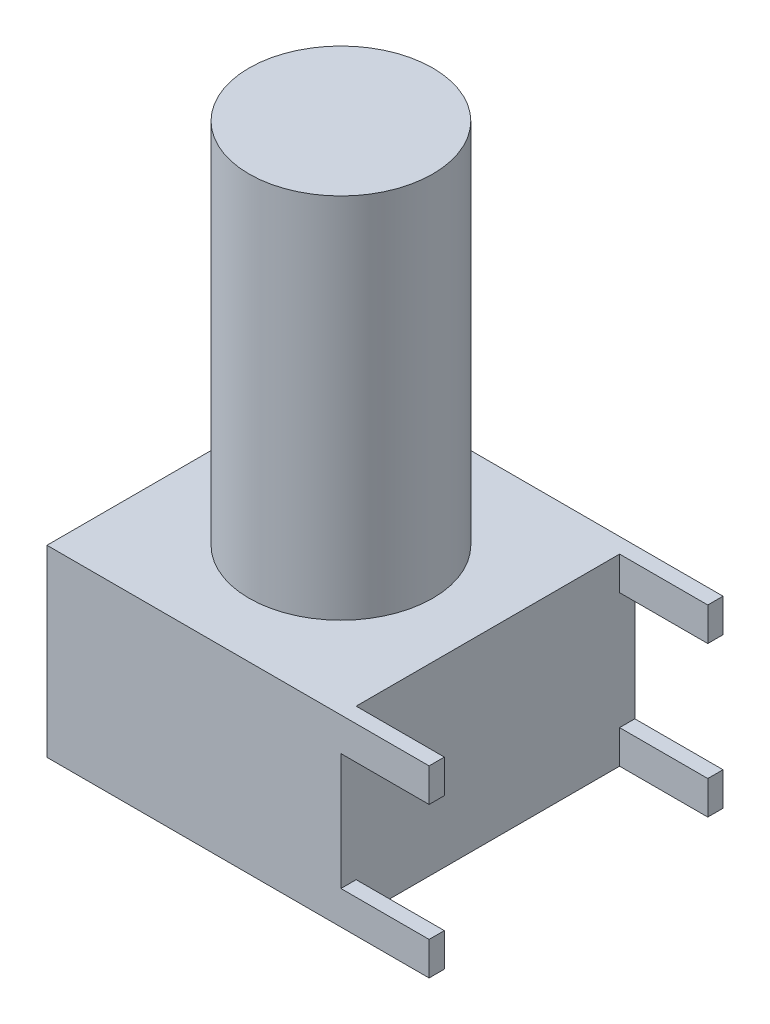
ISO-10303-21;
HEADER;
FILE_DESCRIPTION(('STEP AP214'),'2;1');
FILE_NAME('part.step','',(''),(''),'','','');
FILE_SCHEMA(('AUTOMOTIVE_DESIGN { 1 0 10303 214 1 1 1 1 }'));
ENDSEC;
DATA;
#1=APPLICATION_CONTEXT('core data for automotive mechanical design processes');
#2=APPLICATION_PROTOCOL_DEFINITION('international standard','automotive_design',2000,#1);
#3=PRODUCT_CONTEXT('',#1,'mechanical');
#4=PRODUCT('Part','Part','',(#3));
#5=PRODUCT_RELATED_PRODUCT_CATEGORY('part','',(#4));
#6=PRODUCT_DEFINITION_FORMATION('','',#4);
#7=PRODUCT_DEFINITION_CONTEXT('part definition',#1,'design');
#8=PRODUCT_DEFINITION('design','',#6,#7);
#9=PRODUCT_DEFINITION_SHAPE('','',#8);
#10=(LENGTH_UNIT() NAMED_UNIT(*) SI_UNIT(.MILLI.,.METRE.));
#11=(NAMED_UNIT(*) PLANE_ANGLE_UNIT() SI_UNIT($,.RADIAN.));
#12=(NAMED_UNIT(*) SI_UNIT($,.STERADIAN.) SOLID_ANGLE_UNIT());
#13=UNCERTAINTY_MEASURE_WITH_UNIT(LENGTH_MEASURE(1.E-05),#10,'distance_accuracy_value','');
#14=(GEOMETRIC_REPRESENTATION_CONTEXT(3) GLOBAL_UNCERTAINTY_ASSIGNED_CONTEXT((#13)) GLOBAL_UNIT_ASSIGNED_CONTEXT((#10,
#11,#12)) REPRESENTATION_CONTEXT('',''));
#15=CARTESIAN_POINT('',(0.,0.,0.));
#16=DIRECTION('',(0.,0.,1.));
#17=DIRECTION('',(1.,0.,0.));
#18=AXIS2_PLACEMENT_3D('',#15,#16,#17);
#19=CARTESIAN_POINT('',(5.08,-6.35,5.08));
#20=DIRECTION('',(1.,0.,0.));
#21=DIRECTION('',(0.,0.,-1.));
#22=AXIS2_PLACEMENT_3D('',#19,#20,#21);
#23=PLANE('',#22);
#24=DIRECTION('',(0.,0.,-1.));
#25=VECTOR('',#24,1.);
#26=CARTESIAN_POINT('',(5.08,-5.19481780329537,0.));
#27=LINE('',#26,#25);
#28=CARTESIAN_POINT('',(5.08,-5.19481780329537,5.08));
#29=VERTEX_POINT('',#28);
#30=CARTESIAN_POINT('',(5.08,-5.19481780329537,4.5525943618685));
#31=VERTEX_POINT('',#30);
#32=EDGE_CURVE('E51',#29,#31,#27,.T.);
#33=ORIENTED_EDGE('',*,*,#32,.T.);
#34=DIRECTION('',(0.,1.,0.));
#35=VECTOR('',#34,1.);
#36=CARTESIAN_POINT('',(5.08,0.,4.5525943618685));
#37=LINE('',#36,#35);
#38=CARTESIAN_POINT('',(5.08,-6.35,4.5525943618685));
#39=VERTEX_POINT('',#38);
#40=EDGE_CURVE('E462',#39,#31,#37,.T.);
#41=ORIENTED_EDGE('',*,*,#40,.F.);
#42=DIRECTION('',(0.,0.,-1.));
#43=VECTOR('',#42,1.);
#44=CARTESIAN_POINT('',(5.08,-6.35,5.08));
#45=LINE('',#44,#43);
#46=CARTESIAN_POINT('',(5.08,-6.35,-4.5525943618685));
#47=VERTEX_POINT('',#46);
#48=EDGE_CURVE('E171',#39,#47,#45,.T.);
#49=ORIENTED_EDGE('',*,*,#48,.T.);
#50=DIRECTION('',(0.,1.,0.));
#51=VECTOR('',#50,1.);
#52=CARTESIAN_POINT('',(5.08,0.,-4.5525943618685));
#53=LINE('',#52,#51);
#54=CARTESIAN_POINT('',(5.08,-5.19481780329537,-4.5525943618685));
#55=VERTEX_POINT('',#54);
#56=EDGE_CURVE('E172',#47,#55,#53,.T.);
#57=ORIENTED_EDGE('',*,*,#56,.T.);
#58=DIRECTION('',(0.,0.,1.));
#59=VECTOR('',#58,1.);
#60=CARTESIAN_POINT('',(5.08,-5.19481780329537,0.));
#61=LINE('',#60,#59);
#62=CARTESIAN_POINT('',(5.08,-5.19481780329537,-5.08));
#63=VERTEX_POINT('',#62);
#64=EDGE_CURVE('E174',#63,#55,#61,.T.);
#65=ORIENTED_EDGE('',*,*,#64,.F.);
#66=DIRECTION('',(0.,1.,0.));
#67=VECTOR('',#66,1.);
#68=CARTESIAN_POINT('',(5.08,-6.35,-5.08));
#69=LINE('',#68,#67);
#70=CARTESIAN_POINT('',(5.08,-1.15518219670463,-5.08));
#71=VERTEX_POINT('',#70);
#72=EDGE_CURVE('E274',#63,#71,#69,.T.);
#73=ORIENTED_EDGE('',*,*,#72,.T.);
#74=DIRECTION('',(0.,0.,-1.));
#75=VECTOR('',#74,1.);
#76=CARTESIAN_POINT('',(5.08,-1.15518219670463,0.));
#77=LINE('',#76,#75);
#78=CARTESIAN_POINT('',(5.08,-1.15518219670463,-4.5525943618685));
#79=VERTEX_POINT('',#78);
#80=EDGE_CURVE('E205',#79,#71,#77,.T.);
#81=ORIENTED_EDGE('',*,*,#80,.F.);
#82=DIRECTION('',(0.,1.,0.));
#83=VECTOR('',#82,1.);
#84=CARTESIAN_POINT('',(5.08,0.,-4.5525943618685));
#85=LINE('',#84,#83);
#86=CARTESIAN_POINT('',(5.08,0.,-4.5525943618685));
#87=VERTEX_POINT('',#86);
#88=EDGE_CURVE('E200',#79,#87,#85,.T.);
#89=ORIENTED_EDGE('',*,*,#88,.T.);
#90=DIRECTION('',(0.,0.,-1.));
#91=VECTOR('',#90,1.);
#92=CARTESIAN_POINT('',(5.08,0.,5.08));
#93=LINE('',#92,#91);
#94=CARTESIAN_POINT('',(5.08,0.,4.5525943618685));
#95=VERTEX_POINT('',#94);
#96=EDGE_CURVE('E256',#95,#87,#93,.T.);
#97=ORIENTED_EDGE('',*,*,#96,.F.);
#98=DIRECTION('',(0.,-1.,0.));
#99=VECTOR('',#98,1.);
#100=CARTESIAN_POINT('',(5.08,0.,4.5525943618685));
#101=LINE('',#100,#99);
#102=CARTESIAN_POINT('',(5.08,-1.15518219670463,4.5525943618685));
#103=VERTEX_POINT('',#102);
#104=EDGE_CURVE('E224',#95,#103,#101,.T.);
#105=ORIENTED_EDGE('',*,*,#104,.T.);
#106=DIRECTION('',(0.,0.,-1.));
#107=VECTOR('',#106,1.);
#108=CARTESIAN_POINT('',(5.08,-1.15518219670463,0.));
#109=LINE('',#108,#107);
#110=CARTESIAN_POINT('',(5.08,-1.15518219670463,5.08));
#111=VERTEX_POINT('',#110);
#112=EDGE_CURVE('E229',#111,#103,#109,.T.);
#113=ORIENTED_EDGE('',*,*,#112,.F.);
#114=DIRECTION('',(0.,1.,0.));
#115=VECTOR('',#114,1.);
#116=CARTESIAN_POINT('',(5.08,-6.35,5.08));
#117=LINE('',#116,#115);
#118=EDGE_CURVE('E37',#29,#111,#117,.T.);
#119=ORIENTED_EDGE('',*,*,#118,.F.);
#120=EDGE_LOOP('',(#33,#41,#49,#57,#65,#73,#81,#89,#97,#105,#113,#119));
#121=FACE_BOUND('',#120,.T.);
#122=ADVANCED_FACE('F33',(#121),#23,.T.);
#123=CARTESIAN_POINT('',(0.,12.7,0.));
#124=DIRECTION('',(0.,-1.,0.));
#125=DIRECTION('',(0.,0.,-1.));
#126=AXIS2_PLACEMENT_3D('',#123,#124,#125);
#127=CYLINDRICAL_SURFACE('',#126,3.175);
#128=CARTESIAN_POINT('',(0.,12.7,0.));
#129=DIRECTION('',(0.,1.,0.));
#130=DIRECTION('',(0.,0.,1.));
#131=AXIS2_PLACEMENT_3D('',#128,#129,#130);
#132=CIRCLE('',#131,3.175);
#133=CARTESIAN_POINT('',(0.,12.7,3.175));
#134=VERTEX_POINT('',#133);
#135=EDGE_CURVE('E11',#134,#134,#132,.T.);
#136=ORIENTED_EDGE('',*,*,#135,.F.);
#137=EDGE_LOOP('',(#136));
#138=FACE_BOUND('',#137,.T.);
#139=CARTESIAN_POINT('',(0.,0.,0.));
#140=DIRECTION('',(0.,1.,0.));
#141=DIRECTION('',(0.,0.,1.));
#142=AXIS2_PLACEMENT_3D('',#139,#140,#141);
#143=CIRCLE('',#142,3.175);
#144=CARTESIAN_POINT('',(0.,0.,3.175));
#145=VERTEX_POINT('',#144);
#146=EDGE_CURVE('E43',#145,#145,#143,.T.);
#147=ORIENTED_EDGE('',*,*,#146,.T.);
#148=EDGE_LOOP('',(#147));
#149=FACE_BOUND('',#148,.T.);
#150=ADVANCED_FACE('F35',(#138,#149),#127,.T.);
#151=CARTESIAN_POINT('',(0.,12.7,0.));
#152=DIRECTION('',(0.,1.,0.));
#153=DIRECTION('',(0.,0.,1.));
#154=AXIS2_PLACEMENT_3D('',#151,#152,#153);
#155=PLANE('',#154);
#156=ORIENTED_EDGE('',*,*,#135,.T.);
#157=EDGE_LOOP('',(#156));
#158=FACE_BOUND('',#157,.T.);
#159=ADVANCED_FACE('F283',(#158),#155,.T.);
#160=CARTESIAN_POINT('',(0.,0.,0.));
#161=DIRECTION('',(0.,1.,0.));
#162=DIRECTION('',(0.,0.,1.));
#163=AXIS2_PLACEMENT_3D('',#160,#161,#162);
#164=PLANE('',#163);
#165=DIRECTION('',(1.,0.,0.));
#166=VECTOR('',#165,1.);
#167=CARTESIAN_POINT('',(-5.08,0.,5.08));
#168=LINE('',#167,#166);
#169=CARTESIAN_POINT('',(-5.08,0.,5.08));
#170=VERTEX_POINT('',#169);
#171=CARTESIAN_POINT('',(8.128,0.,5.08));
#172=VERTEX_POINT('',#171);
#173=EDGE_CURVE('E246',#170,#172,#168,.T.);
#174=ORIENTED_EDGE('',*,*,#173,.T.);
#175=DIRECTION('',(0.,0.,1.));
#176=VECTOR('',#175,1.);
#177=CARTESIAN_POINT('',(8.128,0.,0.));
#178=LINE('',#177,#176);
#179=CARTESIAN_POINT('',(8.128,0.,4.5525943618685));
#180=VERTEX_POINT('',#179);
#181=EDGE_CURVE('E228',#180,#172,#178,.T.);
#182=ORIENTED_EDGE('',*,*,#181,.F.);
#183=DIRECTION('',(-1.,0.,0.));
#184=VECTOR('',#183,1.);
#185=CARTESIAN_POINT('',(8.128,0.,4.5525943618685));
#186=LINE('',#185,#184);
#187=EDGE_CURVE('E243',#180,#95,#186,.T.);
#188=ORIENTED_EDGE('',*,*,#187,.T.);
#189=ORIENTED_EDGE('',*,*,#96,.T.);
#190=DIRECTION('',(-1.,0.,0.));
#191=VECTOR('',#190,1.);
#192=CARTESIAN_POINT('',(8.128,0.,-4.5525943618685));
#193=LINE('',#192,#191);
#194=CARTESIAN_POINT('',(8.128,0.,-4.5525943618685));
#195=VERTEX_POINT('',#194);
#196=EDGE_CURVE('E212',#195,#87,#193,.T.);
#197=ORIENTED_EDGE('',*,*,#196,.F.);
#198=DIRECTION('',(0.,0.,1.));
#199=VECTOR('',#198,1.);
#200=CARTESIAN_POINT('',(8.128,0.,0.));
#201=LINE('',#200,#199);
#202=CARTESIAN_POINT('',(8.128,0.,-5.08));
#203=VERTEX_POINT('',#202);
#204=EDGE_CURVE('E210',#203,#195,#201,.T.);
#205=ORIENTED_EDGE('',*,*,#204,.F.);
#206=DIRECTION('',(1.,0.,0.));
#207=VECTOR('',#206,1.);
#208=CARTESIAN_POINT('',(-5.08,0.,-5.08));
#209=LINE('',#208,#207);
#210=CARTESIAN_POINT('',(-5.08,0.,-5.08));
#211=VERTEX_POINT('',#210);
#212=EDGE_CURVE('E259',#211,#203,#209,.T.);
#213=ORIENTED_EDGE('',*,*,#212,.F.);
#214=DIRECTION('',(0.,0.,-1.));
#215=VECTOR('',#214,1.);
#216=CARTESIAN_POINT('',(-5.08,0.,5.08));
#217=LINE('',#216,#215);
#218=EDGE_CURVE('E266',#170,#211,#217,.T.);
#219=ORIENTED_EDGE('',*,*,#218,.F.);
#220=EDGE_LOOP('',(#174,#182,#188,#189,#197,#205,#213,#219));
#221=FACE_BOUND('',#220,.T.);
#222=ORIENTED_EDGE('',*,*,#146,.F.);
#223=EDGE_LOOP('',(#222));
#224=FACE_BOUND('',#223,.T.);
#225=ADVANCED_FACE('F280',(#221,#224),#164,.T.);
#226=CARTESIAN_POINT('',(-5.08,-6.35,5.08));
#227=DIRECTION('',(0.,0.,1.));
#228=DIRECTION('',(1.,0.,0.));
#229=AXIS2_PLACEMENT_3D('',#226,#227,#228);
#230=PLANE('',#229);
#231=ORIENTED_EDGE('',*,*,#173,.F.);
#232=DIRECTION('',(0.,1.,0.));
#233=VECTOR('',#232,1.);
#234=CARTESIAN_POINT('',(-5.08,-6.35,5.08));
#235=LINE('',#234,#233);
#236=CARTESIAN_POINT('',(-5.08,-6.35,5.08));
#237=VERTEX_POINT('',#236);
#238=EDGE_CURVE('E269',#237,#170,#235,.T.);
#239=ORIENTED_EDGE('',*,*,#238,.F.);
#240=DIRECTION('',(1.,0.,0.));
#241=VECTOR('',#240,1.);
#242=CARTESIAN_POINT('',(-5.08,-6.35,5.08));
#243=LINE('',#242,#241);
#244=CARTESIAN_POINT('',(8.128,-6.35,5.08));
#245=VERTEX_POINT('',#244);
#246=EDGE_CURVE('E268',#237,#245,#243,.T.);
#247=ORIENTED_EDGE('',*,*,#246,.T.);
#248=DIRECTION('',(0.,-1.,0.));
#249=VECTOR('',#248,1.);
#250=CARTESIAN_POINT('',(8.128,0.,5.08));
#251=LINE('',#250,#249);
#252=CARTESIAN_POINT('',(8.128,-5.19481780329537,5.08));
#253=VERTEX_POINT('',#252);
#254=EDGE_CURVE('E165',#253,#245,#251,.T.);
#255=ORIENTED_EDGE('',*,*,#254,.F.);
#256=DIRECTION('',(-1.,0.,0.));
#257=VECTOR('',#256,1.);
#258=CARTESIAN_POINT('',(8.128,-5.19481780329537,5.08));
#259=LINE('',#258,#257);
#260=EDGE_CURVE('E176',#253,#29,#259,.T.);
#261=ORIENTED_EDGE('',*,*,#260,.T.);
#262=ORIENTED_EDGE('',*,*,#118,.T.);
#263=DIRECTION('',(-1.,0.,0.));
#264=VECTOR('',#263,1.);
#265=CARTESIAN_POINT('',(8.128,-1.15518219670463,5.08));
#266=LINE('',#265,#264);
#267=CARTESIAN_POINT('',(8.128,-1.15518219670463,5.08));
#268=VERTEX_POINT('',#267);
#269=EDGE_CURVE('E247',#268,#111,#266,.T.);
#270=ORIENTED_EDGE('',*,*,#269,.F.);
#271=DIRECTION('',(0.,-1.,0.));
#272=VECTOR('',#271,1.);
#273=CARTESIAN_POINT('',(8.128,0.,5.08));
#274=LINE('',#273,#272);
#275=EDGE_CURVE('E232',#172,#268,#274,.T.);
#276=ORIENTED_EDGE('',*,*,#275,.F.);
#277=EDGE_LOOP('',(#231,#239,#247,#255,#261,#262,#270,#276));
#278=FACE_BOUND('',#277,.T.);
#279=ADVANCED_FACE('F282',(#278),#230,.T.);
#280=CARTESIAN_POINT('',(-5.08,-6.35,5.08));
#281=DIRECTION('',(1.,0.,0.));
#282=DIRECTION('',(0.,0.,-1.));
#283=AXIS2_PLACEMENT_3D('',#280,#281,#282);
#284=PLANE('',#283);
#285=ORIENTED_EDGE('',*,*,#218,.T.);
#286=DIRECTION('',(0.,1.,0.));
#287=VECTOR('',#286,1.);
#288=CARTESIAN_POINT('',(-5.08,-6.35,-5.08));
#289=LINE('',#288,#287);
#290=CARTESIAN_POINT('',(-5.08,-6.35,-5.08));
#291=VERTEX_POINT('',#290);
#292=EDGE_CURVE('E271',#291,#211,#289,.T.);
#293=ORIENTED_EDGE('',*,*,#292,.F.);
#294=DIRECTION('',(0.,0.,-1.));
#295=VECTOR('',#294,1.);
#296=CARTESIAN_POINT('',(-5.08,-6.35,5.08));
#297=LINE('',#296,#295);
#298=EDGE_CURVE('E340',#237,#291,#297,.T.);
#299=ORIENTED_EDGE('',*,*,#298,.F.);
#300=ORIENTED_EDGE('',*,*,#238,.T.);
#301=EDGE_LOOP('',(#285,#293,#299,#300));
#302=FACE_BOUND('',#301,.T.);
#303=ADVANCED_FACE('F290',(#302),#284,.F.);
#304=CARTESIAN_POINT('',(-5.08,-6.35,-5.08));
#305=DIRECTION('',(0.,0.,1.));
#306=DIRECTION('',(1.,0.,0.));
#307=AXIS2_PLACEMENT_3D('',#304,#305,#306);
#308=PLANE('',#307);
#309=ORIENTED_EDGE('',*,*,#212,.T.);
#310=DIRECTION('',(0.,1.,0.));
#311=VECTOR('',#310,1.);
#312=CARTESIAN_POINT('',(8.128,0.,-5.08));
#313=LINE('',#312,#311);
#314=CARTESIAN_POINT('',(8.128,-1.15518219670463,-5.08));
#315=VERTEX_POINT('',#314);
#316=EDGE_CURVE('E207',#315,#203,#313,.T.);
#317=ORIENTED_EDGE('',*,*,#316,.F.);
#318=DIRECTION('',(-1.,0.,0.));
#319=VECTOR('',#318,1.);
#320=CARTESIAN_POINT('',(8.128,-1.15518219670463,-5.08));
#321=LINE('',#320,#319);
#322=EDGE_CURVE('E218',#315,#71,#321,.T.);
#323=ORIENTED_EDGE('',*,*,#322,.T.);
#324=ORIENTED_EDGE('',*,*,#72,.F.);
#325=DIRECTION('',(-1.,0.,0.));
#326=VECTOR('',#325,1.);
#327=CARTESIAN_POINT('',(8.128,-5.19481780329537,-5.08));
#328=LINE('',#327,#326);
#329=CARTESIAN_POINT('',(8.128,-5.19481780329537,-5.08));
#330=VERTEX_POINT('',#329);
#331=EDGE_CURVE('E195',#330,#63,#328,.T.);
#332=ORIENTED_EDGE('',*,*,#331,.F.);
#333=DIRECTION('',(0.,1.,0.));
#334=VECTOR('',#333,1.);
#335=CARTESIAN_POINT('',(8.128,0.,-5.08));
#336=LINE('',#335,#334);
#337=CARTESIAN_POINT('',(8.128,-6.35,-5.08));
#338=VERTEX_POINT('',#337);
#339=EDGE_CURVE('E186',#338,#330,#336,.T.);
#340=ORIENTED_EDGE('',*,*,#339,.F.);
#341=DIRECTION('',(1.,0.,0.));
#342=VECTOR('',#341,1.);
#343=CARTESIAN_POINT('',(-5.08,-6.35,-5.08));
#344=LINE('',#343,#342);
#345=EDGE_CURVE('E318',#291,#338,#344,.T.);
#346=ORIENTED_EDGE('',*,*,#345,.F.);
#347=ORIENTED_EDGE('',*,*,#292,.T.);
#348=EDGE_LOOP('',(#309,#317,#323,#324,#332,#340,#346,#347));
#349=FACE_BOUND('',#348,.T.);
#350=ADVANCED_FACE('F303',(#349),#308,.F.);
#351=CARTESIAN_POINT('',(0.,-6.35,0.));
#352=DIRECTION('',(0.,1.,0.));
#353=DIRECTION('',(0.,0.,1.));
#354=AXIS2_PLACEMENT_3D('',#351,#352,#353);
#355=PLANE('',#354);
#356=ORIENTED_EDGE('',*,*,#246,.F.);
#357=ORIENTED_EDGE('',*,*,#298,.T.);
#358=ORIENTED_EDGE('',*,*,#345,.T.);
#359=DIRECTION('',(0.,0.,-1.));
#360=VECTOR('',#359,1.);
#361=CARTESIAN_POINT('',(8.128,-6.35,0.));
#362=LINE('',#361,#360);
#363=CARTESIAN_POINT('',(8.128,-6.35,-4.5525943618685));
#364=VERTEX_POINT('',#363);
#365=EDGE_CURVE('E183',#364,#338,#362,.T.);
#366=ORIENTED_EDGE('',*,*,#365,.F.);
#367=DIRECTION('',(-1.,0.,0.));
#368=VECTOR('',#367,1.);
#369=CARTESIAN_POINT('',(8.128,-6.35,-4.5525943618685));
#370=LINE('',#369,#368);
#371=EDGE_CURVE('E198',#364,#47,#370,.T.);
#372=ORIENTED_EDGE('',*,*,#371,.T.);
#373=ORIENTED_EDGE('',*,*,#48,.F.);
#374=DIRECTION('',(-1.,0.,0.));
#375=VECTOR('',#374,1.);
#376=CARTESIAN_POINT('',(8.128,-6.35,4.5525943618685));
#377=LINE('',#376,#375);
#378=CARTESIAN_POINT('',(8.128,-6.35,4.5525943618685));
#379=VERTEX_POINT('',#378);
#380=EDGE_CURVE('E153',#379,#39,#377,.T.);
#381=ORIENTED_EDGE('',*,*,#380,.F.);
#382=DIRECTION('',(0.,0.,-1.));
#383=VECTOR('',#382,1.);
#384=CARTESIAN_POINT('',(8.128,-6.35,0.));
#385=LINE('',#384,#383);
#386=EDGE_CURVE('E159',#245,#379,#385,.T.);
#387=ORIENTED_EDGE('',*,*,#386,.F.);
#388=EDGE_LOOP('',(#356,#357,#358,#366,#372,#373,#381,#387));
#389=FACE_BOUND('',#388,.T.);
#390=ADVANCED_FACE('F169',(#389),#355,.F.);
#391=CARTESIAN_POINT('',(8.128,0.,4.5525943618685));
#392=DIRECTION('',(0.,0.,-1.));
#393=DIRECTION('',(-1.,0.,0.));
#394=AXIS2_PLACEMENT_3D('',#391,#392,#393);
#395=PLANE('',#394);
#396=ORIENTED_EDGE('',*,*,#104,.F.);
#397=ORIENTED_EDGE('',*,*,#187,.F.);
#398=DIRECTION('',(0.,-1.,0.));
#399=VECTOR('',#398,1.);
#400=CARTESIAN_POINT('',(8.128,0.,4.5525943618685));
#401=LINE('',#400,#399);
#402=CARTESIAN_POINT('',(8.128,-1.15518219670463,4.5525943618685));
#403=VERTEX_POINT('',#402);
#404=EDGE_CURVE('E225',#180,#403,#401,.T.);
#405=ORIENTED_EDGE('',*,*,#404,.T.);
#406=DIRECTION('',(-1.,0.,0.));
#407=VECTOR('',#406,1.);
#408=CARTESIAN_POINT('',(8.128,-1.15518219670463,4.5525943618685));
#409=LINE('',#408,#407);
#410=EDGE_CURVE('E236',#403,#103,#409,.T.);
#411=ORIENTED_EDGE('',*,*,#410,.T.);
#412=EDGE_LOOP('',(#396,#397,#405,#411));
#413=FACE_BOUND('',#412,.T.);
#414=ADVANCED_FACE('F354',(#413),#395,.T.);
#415=CARTESIAN_POINT('',(8.128,-1.15518219670463,0.));
#416=DIRECTION('',(0.,1.,0.));
#417=DIRECTION('',(0.,0.,1.));
#418=AXIS2_PLACEMENT_3D('',#415,#416,#417);
#419=PLANE('',#418);
#420=ORIENTED_EDGE('',*,*,#112,.T.);
#421=ORIENTED_EDGE('',*,*,#410,.F.);
#422=DIRECTION('',(0.,0.,-1.));
#423=VECTOR('',#422,1.);
#424=CARTESIAN_POINT('',(8.128,-1.15518219670463,0.));
#425=LINE('',#424,#423);
#426=EDGE_CURVE('E234',#268,#403,#425,.T.);
#427=ORIENTED_EDGE('',*,*,#426,.F.);
#428=ORIENTED_EDGE('',*,*,#269,.T.);
#429=EDGE_LOOP('',(#420,#421,#427,#428));
#430=FACE_BOUND('',#429,.T.);
#431=ADVANCED_FACE('F364',(#430),#419,.F.);
#432=CARTESIAN_POINT('',(8.128,0.,0.));
#433=DIRECTION('',(1.,0.,0.));
#434=DIRECTION('',(0.,0.,-1.));
#435=AXIS2_PLACEMENT_3D('',#432,#433,#434);
#436=PLANE('',#435);
#437=ORIENTED_EDGE('',*,*,#404,.F.);
#438=ORIENTED_EDGE('',*,*,#181,.T.);
#439=ORIENTED_EDGE('',*,*,#275,.T.);
#440=ORIENTED_EDGE('',*,*,#426,.T.);
#441=EDGE_LOOP('',(#437,#438,#439,#440));
#442=FACE_BOUND('',#441,.T.);
#443=ADVANCED_FACE('F348',(#442),#436,.T.);
#444=CARTESIAN_POINT('',(8.128,0.,-4.5525943618685));
#445=DIRECTION('',(0.,0.,1.));
#446=DIRECTION('',(1.,0.,0.));
#447=AXIS2_PLACEMENT_3D('',#444,#445,#446);
#448=PLANE('',#447);
#449=ORIENTED_EDGE('',*,*,#88,.F.);
#450=DIRECTION('',(-1.,0.,0.));
#451=VECTOR('',#450,1.);
#452=CARTESIAN_POINT('',(8.128,-1.15518219670463,-4.5525943618685));
#453=LINE('',#452,#451);
#454=CARTESIAN_POINT('',(8.128,-1.15518219670463,-4.5525943618685));
#455=VERTEX_POINT('',#454);
#456=EDGE_CURVE('E221',#455,#79,#453,.T.);
#457=ORIENTED_EDGE('',*,*,#456,.F.);
#458=DIRECTION('',(0.,1.,0.));
#459=VECTOR('',#458,1.);
#460=CARTESIAN_POINT('',(8.128,0.,-4.5525943618685));
#461=LINE('',#460,#459);
#462=EDGE_CURVE('E201',#455,#195,#461,.T.);
#463=ORIENTED_EDGE('',*,*,#462,.T.);
#464=ORIENTED_EDGE('',*,*,#196,.T.);
#465=EDGE_LOOP('',(#449,#457,#463,#464));
#466=FACE_BOUND('',#465,.T.);
#467=ADVANCED_FACE('F356',(#466),#448,.T.);
#468=CARTESIAN_POINT('',(8.128,-1.15518219670463,0.));
#469=DIRECTION('',(0.,1.,0.));
#470=DIRECTION('',(0.,0.,1.));
#471=AXIS2_PLACEMENT_3D('',#468,#469,#470);
#472=PLANE('',#471);
#473=ORIENTED_EDGE('',*,*,#80,.T.);
#474=ORIENTED_EDGE('',*,*,#322,.F.);
#475=DIRECTION('',(0.,0.,-1.));
#476=VECTOR('',#475,1.);
#477=CARTESIAN_POINT('',(8.128,-1.15518219670463,0.));
#478=LINE('',#477,#476);
#479=EDGE_CURVE('E204',#455,#315,#478,.T.);
#480=ORIENTED_EDGE('',*,*,#479,.F.);
#481=ORIENTED_EDGE('',*,*,#456,.T.);
#482=EDGE_LOOP('',(#473,#474,#480,#481));
#483=FACE_BOUND('',#482,.T.);
#484=ADVANCED_FACE('F329',(#483),#472,.F.);
#485=CARTESIAN_POINT('',(8.128,0.,0.));
#486=DIRECTION('',(1.,0.,0.));
#487=DIRECTION('',(0.,0.,-1.));
#488=AXIS2_PLACEMENT_3D('',#485,#486,#487);
#489=PLANE('',#488);
#490=ORIENTED_EDGE('',*,*,#462,.F.);
#491=ORIENTED_EDGE('',*,*,#479,.T.);
#492=ORIENTED_EDGE('',*,*,#316,.T.);
#493=ORIENTED_EDGE('',*,*,#204,.T.);
#494=EDGE_LOOP('',(#490,#491,#492,#493));
#495=FACE_BOUND('',#494,.T.);
#496=ADVANCED_FACE('F323',(#495),#489,.T.);
#497=CARTESIAN_POINT('',(8.128,0.,-4.5525943618685));
#498=DIRECTION('',(0.,0.,1.));
#499=DIRECTION('',(1.,0.,0.));
#500=AXIS2_PLACEMENT_3D('',#497,#498,#499);
#501=PLANE('',#500);
#502=ORIENTED_EDGE('',*,*,#56,.F.);
#503=ORIENTED_EDGE('',*,*,#371,.F.);
#504=DIRECTION('',(0.,1.,0.));
#505=VECTOR('',#504,1.);
#506=CARTESIAN_POINT('',(8.128,0.,-4.5525943618685));
#507=LINE('',#506,#505);
#508=CARTESIAN_POINT('',(8.128,-5.19481780329537,-4.5525943618685));
#509=VERTEX_POINT('',#508);
#510=EDGE_CURVE('E180',#364,#509,#507,.T.);
#511=ORIENTED_EDGE('',*,*,#510,.T.);
#512=DIRECTION('',(-1.,0.,0.));
#513=VECTOR('',#512,1.);
#514=CARTESIAN_POINT('',(8.128,-5.19481780329537,-4.5525943618685));
#515=LINE('',#514,#513);
#516=EDGE_CURVE('E189',#509,#55,#515,.T.);
#517=ORIENTED_EDGE('',*,*,#516,.T.);
#518=EDGE_LOOP('',(#502,#503,#511,#517));
#519=FACE_BOUND('',#518,.T.);
#520=ADVANCED_FACE('F408',(#519),#501,.T.);
#521=CARTESIAN_POINT('',(8.128,-5.19481780329537,0.));
#522=DIRECTION('',(0.,-1.,0.));
#523=DIRECTION('',(0.,0.,-1.));
#524=AXIS2_PLACEMENT_3D('',#521,#522,#523);
#525=PLANE('',#524);
#526=ORIENTED_EDGE('',*,*,#64,.T.);
#527=ORIENTED_EDGE('',*,*,#516,.F.);
#528=DIRECTION('',(0.,0.,1.));
#529=VECTOR('',#528,1.);
#530=CARTESIAN_POINT('',(8.128,-5.19481780329537,0.));
#531=LINE('',#530,#529);
#532=EDGE_CURVE('E188',#330,#509,#531,.T.);
#533=ORIENTED_EDGE('',*,*,#532,.F.);
#534=ORIENTED_EDGE('',*,*,#331,.T.);
#535=EDGE_LOOP('',(#526,#527,#533,#534));
#536=FACE_BOUND('',#535,.T.);
#537=ADVANCED_FACE('F334',(#536),#525,.F.);
#538=CARTESIAN_POINT('',(8.128,0.,0.));
#539=DIRECTION('',(1.,0.,0.));
#540=DIRECTION('',(0.,0.,-1.));
#541=AXIS2_PLACEMENT_3D('',#538,#539,#540);
#542=PLANE('',#541);
#543=ORIENTED_EDGE('',*,*,#510,.F.);
#544=ORIENTED_EDGE('',*,*,#365,.T.);
#545=ORIENTED_EDGE('',*,*,#339,.T.);
#546=ORIENTED_EDGE('',*,*,#532,.T.);
#547=EDGE_LOOP('',(#543,#544,#545,#546));
#548=FACE_BOUND('',#547,.T.);
#549=ADVANCED_FACE('F338',(#548),#542,.T.);
#550=CARTESIAN_POINT('',(8.128,0.,4.5525943618685));
#551=DIRECTION('',(0.,0.,1.));
#552=DIRECTION('',(1.,0.,0.));
#553=AXIS2_PLACEMENT_3D('',#550,#551,#552);
#554=PLANE('',#553);
#555=ORIENTED_EDGE('',*,*,#40,.T.);
#556=DIRECTION('',(-1.,0.,0.));
#557=VECTOR('',#556,1.);
#558=CARTESIAN_POINT('',(8.128,-5.19481780329537,4.5525943618685));
#559=LINE('',#558,#557);
#560=CARTESIAN_POINT('',(8.128,-5.19481780329537,4.5525943618685));
#561=VERTEX_POINT('',#560);
#562=EDGE_CURVE('E154',#561,#31,#559,.T.);
#563=ORIENTED_EDGE('',*,*,#562,.F.);
#564=DIRECTION('',(0.,1.,0.));
#565=VECTOR('',#564,1.);
#566=CARTESIAN_POINT('',(8.128,0.,4.5525943618685));
#567=LINE('',#566,#565);
#568=EDGE_CURVE('E148',#379,#561,#567,.T.);
#569=ORIENTED_EDGE('',*,*,#568,.F.);
#570=ORIENTED_EDGE('',*,*,#380,.T.);
#571=EDGE_LOOP('',(#555,#563,#569,#570));
#572=FACE_BOUND('',#571,.T.);
#573=ADVANCED_FACE('F151',(#572),#554,.F.);
#574=CARTESIAN_POINT('',(8.128,-5.19481780329537,0.));
#575=DIRECTION('',(0.,1.,0.));
#576=DIRECTION('',(0.,0.,1.));
#577=AXIS2_PLACEMENT_3D('',#574,#575,#576);
#578=PLANE('',#577);
#579=ORIENTED_EDGE('',*,*,#32,.F.);
#580=ORIENTED_EDGE('',*,*,#260,.F.);
#581=DIRECTION('',(0.,0.,-1.));
#582=VECTOR('',#581,1.);
#583=CARTESIAN_POINT('',(8.128,-5.19481780329537,0.));
#584=LINE('',#583,#582);
#585=EDGE_CURVE('E158',#253,#561,#584,.T.);
#586=ORIENTED_EDGE('',*,*,#585,.T.);
#587=ORIENTED_EDGE('',*,*,#562,.T.);
#588=EDGE_LOOP('',(#579,#580,#586,#587));
#589=FACE_BOUND('',#588,.T.);
#590=ADVANCED_FACE('F441',(#589),#578,.T.);
#591=CARTESIAN_POINT('',(8.128,0.,0.));
#592=DIRECTION('',(1.,0.,0.));
#593=DIRECTION('',(0.,0.,-1.));
#594=AXIS2_PLACEMENT_3D('',#591,#592,#593);
#595=PLANE('',#594);
#596=ORIENTED_EDGE('',*,*,#386,.T.);
#597=ORIENTED_EDGE('',*,*,#568,.T.);
#598=ORIENTED_EDGE('',*,*,#585,.F.);
#599=ORIENTED_EDGE('',*,*,#254,.T.);
#600=EDGE_LOOP('',(#596,#597,#598,#599));
#601=FACE_BOUND('',#600,.T.);
#602=ADVANCED_FACE('F163',(#601),#595,.T.);
#603=CLOSED_SHELL('',(#122,#150,#159,#225,#279,#303,#350,#390,#414,#431,#443,#467,#484,#496,
#520,#537,#549,#573,#590,#602));
#604=MANIFOLD_SOLID_BREP('B2',#603);
#605=ADVANCED_BREP_SHAPE_REPRESENTATION('',(#18,#604),#14);
#606=SHAPE_DEFINITION_REPRESENTATION(#9,#605);
ENDSEC;
END-ISO-10303-21;
